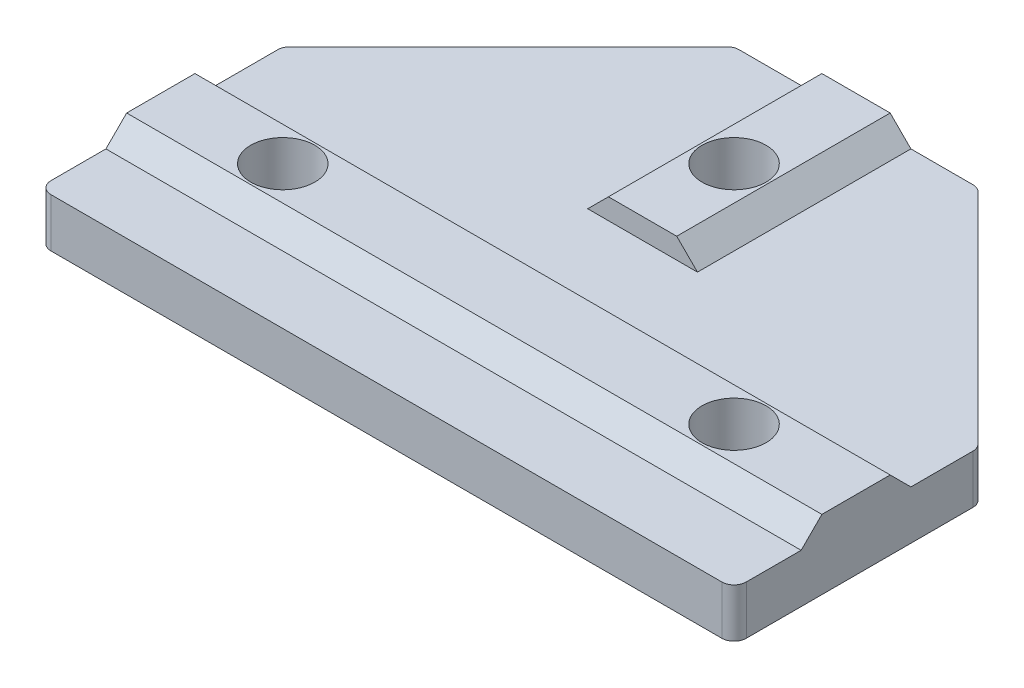
ISO-10303-21;
HEADER;
FILE_DESCRIPTION(('STEP AP214'),'2;1');
FILE_NAME('part.step','',(''),(''),'','','');
FILE_SCHEMA(('AUTOMOTIVE_DESIGN { 1 0 10303 214 1 1 1 1 }'));
ENDSEC;
DATA;
#1=APPLICATION_CONTEXT('core data for automotive mechanical design processes');
#2=APPLICATION_PROTOCOL_DEFINITION('international standard','automotive_design',2000,#1);
#3=PRODUCT_CONTEXT('',#1,'mechanical');
#4=PRODUCT('Part','Part','',(#3));
#5=PRODUCT_RELATED_PRODUCT_CATEGORY('part','',(#4));
#6=PRODUCT_DEFINITION_FORMATION('','',#4);
#7=PRODUCT_DEFINITION_CONTEXT('part definition',#1,'design');
#8=PRODUCT_DEFINITION('design','',#6,#7);
#9=PRODUCT_DEFINITION_SHAPE('','',#8);
#10=(LENGTH_UNIT() NAMED_UNIT(*) SI_UNIT(.MILLI.,.METRE.));
#11=(NAMED_UNIT(*) PLANE_ANGLE_UNIT() SI_UNIT($,.RADIAN.));
#12=(NAMED_UNIT(*) SI_UNIT($,.STERADIAN.) SOLID_ANGLE_UNIT());
#13=UNCERTAINTY_MEASURE_WITH_UNIT(LENGTH_MEASURE(1.E-05),#10,'distance_accuracy_value','');
#14=(GEOMETRIC_REPRESENTATION_CONTEXT(3) GLOBAL_UNCERTAINTY_ASSIGNED_CONTEXT((#13)) GLOBAL_UNIT_ASSIGNED_CONTEXT((#10,
#11,#12)) REPRESENTATION_CONTEXT('',''));
#15=CARTESIAN_POINT('',(0.,0.,0.));
#16=DIRECTION('',(0.,0.,1.));
#17=DIRECTION('',(1.,0.,0.));
#18=AXIS2_PLACEMENT_3D('',#15,#16,#17);
#19=CARTESIAN_POINT('',(0.,4.,0.));
#20=DIRECTION('',(0.,1.,0.));
#21=DIRECTION('',(0.,0.,1.));
#22=AXIS2_PLACEMENT_3D('',#19,#20,#21);
#23=PLANE('',#22);
#24=DIRECTION('',(0.,0.,1.));
#25=VECTOR('',#24,1.);
#26=CARTESIAN_POINT('',(0.,4.,-20.0000000000001));
#27=LINE('',#26,#25);
#28=CARTESIAN_POINT('',(0.,4.,-5.5));
#29=VERTEX_POINT('',#28);
#30=CARTESIAN_POINT('',(0.,4.,-1.));
#31=VERTEX_POINT('',#30);
#32=EDGE_CURVE('E173',#29,#31,#27,.T.);
#33=ORIENTED_EDGE('',*,*,#32,.T.);
#34=CARTESIAN_POINT('',(1.,4.,-1.));
#35=DIRECTION('',(0.,1.,0.));
#36=DIRECTION('',(0.,0.,1.));
#37=AXIS2_PLACEMENT_3D('',#34,#35,#36);
#38=CIRCLE('',#37,1.);
#39=CARTESIAN_POINT('',(1.,4.,0.));
#40=VERTEX_POINT('',#39);
#41=EDGE_CURVE('E250',#31,#40,#38,.T.);
#42=ORIENTED_EDGE('',*,*,#41,.T.);
#43=DIRECTION('',(1.,0.,0.));
#44=VECTOR('',#43,1.);
#45=CARTESIAN_POINT('',(0.,4.,0.));
#46=LINE('',#45,#44);
#47=CARTESIAN_POINT('',(56.,4.,0.));
#48=VERTEX_POINT('',#47);
#49=EDGE_CURVE('E342',#40,#48,#46,.T.);
#50=ORIENTED_EDGE('',*,*,#49,.T.);
#51=CARTESIAN_POINT('',(56.,4.,-1.));
#52=DIRECTION('',(0.,1.,0.));
#53=DIRECTION('',(0.,0.,1.));
#54=AXIS2_PLACEMENT_3D('',#51,#52,#53);
#55=CIRCLE('',#54,1.);
#56=CARTESIAN_POINT('',(57.,4.,-1.));
#57=VERTEX_POINT('',#56);
#58=EDGE_CURVE('E48',#48,#57,#55,.T.);
#59=ORIENTED_EDGE('',*,*,#58,.T.);
#60=DIRECTION('',(0.,0.,-1.));
#61=VECTOR('',#60,1.);
#62=CARTESIAN_POINT('',(57.,4.,0.));
#63=LINE('',#62,#61);
#64=CARTESIAN_POINT('',(57.,4.,-5.5));
#65=VERTEX_POINT('',#64);
#66=EDGE_CURVE('E175',#57,#65,#63,.T.);
#67=ORIENTED_EDGE('',*,*,#66,.T.);
#68=DIRECTION('',(1.,0.,0.));
#69=VECTOR('',#68,1.);
#70=CARTESIAN_POINT('',(0.,4.,-5.5));
#71=LINE('',#70,#69);
#72=EDGE_CURVE('E171',#29,#65,#71,.T.);
#73=ORIENTED_EDGE('',*,*,#72,.F.);
#74=EDGE_LOOP('',(#33,#42,#50,#59,#67,#73));
#75=FACE_BOUND('',#74,.T.);
#76=ADVANCED_FACE('F33',(#75),#23,.T.);
#77=DIRECTION('',(-1.,0.,0.));
#78=VECTOR('',#77,1.);
#79=CARTESIAN_POINT('',(38.5,4.,-38.5));
#80=LINE('',#79,#78);
#81=CARTESIAN_POINT('',(24.,4.,-38.5));
#82=VERTEX_POINT('',#81);
#83=CARTESIAN_POINT('',(18.9142135623731,4.,-38.5));
#84=VERTEX_POINT('',#83);
#85=EDGE_CURVE('E274',#82,#84,#80,.T.);
#86=ORIENTED_EDGE('',*,*,#85,.T.);
#87=CARTESIAN_POINT('',(18.9142135623731,4.,-37.5));
#88=DIRECTION('',(0.,1.,0.));
#89=DIRECTION('',(0.,0.,1.));
#90=AXIS2_PLACEMENT_3D('',#87,#88,#89);
#91=CIRCLE('',#90,1.);
#92=CARTESIAN_POINT('',(18.2071067811866,4.,-38.2071067811866));
#93=VERTEX_POINT('',#92);
#94=EDGE_CURVE('E239',#84,#93,#91,.T.);
#95=ORIENTED_EDGE('',*,*,#94,.T.);
#96=DIRECTION('',(-0.707106781186549,0.,0.707106781186546));
#97=VECTOR('',#96,1.);
#98=CARTESIAN_POINT('',(18.5,4.,-38.5));
#99=LINE('',#98,#97);
#100=CARTESIAN_POINT('',(0.292893218813459,4.,-20.2928932188135));
#101=VERTEX_POINT('',#100);
#102=EDGE_CURVE('E299',#93,#101,#99,.T.);
#103=ORIENTED_EDGE('',*,*,#102,.T.);
#104=CARTESIAN_POINT('',(1.,4.,-19.585786437627));
#105=DIRECTION('',(0.,1.,0.));
#106=DIRECTION('',(0.,0.,1.));
#107=AXIS2_PLACEMENT_3D('',#104,#105,#106);
#108=CIRCLE('',#107,1.);
#109=CARTESIAN_POINT('',(0.,4.,-19.585786437627));
#110=VERTEX_POINT('',#109);
#111=EDGE_CURVE('E237',#101,#110,#108,.T.);
#112=ORIENTED_EDGE('',*,*,#111,.T.);
#113=CARTESIAN_POINT('',(0.,4.,-14.5));
#114=VERTEX_POINT('',#113);
#115=EDGE_CURVE('E191',#110,#114,#27,.T.);
#116=ORIENTED_EDGE('',*,*,#115,.T.);
#117=DIRECTION('',(-1.,0.,0.));
#118=VECTOR('',#117,1.);
#119=CARTESIAN_POINT('',(0.,4.,-14.5));
#120=LINE('',#119,#118);
#121=CARTESIAN_POINT('',(57.,4.,-14.5));
#122=VERTEX_POINT('',#121);
#123=EDGE_CURVE('E179',#122,#114,#120,.T.);
#124=ORIENTED_EDGE('',*,*,#123,.F.);
#125=CARTESIAN_POINT('',(57.,4.,-19.585786437627));
#126=VERTEX_POINT('',#125);
#127=EDGE_CURVE('E344',#122,#126,#63,.T.);
#128=ORIENTED_EDGE('',*,*,#127,.T.);
#129=CARTESIAN_POINT('',(56.,4.,-19.585786437627));
#130=DIRECTION('',(0.,1.,0.));
#131=DIRECTION('',(0.,0.,1.));
#132=AXIS2_PLACEMENT_3D('',#129,#130,#131);
#133=CIRCLE('',#132,1.);
#134=CARTESIAN_POINT('',(56.7071067811865,4.,-20.2928932188135));
#135=VERTEX_POINT('',#134);
#136=EDGE_CURVE('E235',#126,#135,#133,.T.);
#137=ORIENTED_EDGE('',*,*,#136,.T.);
#138=DIRECTION('',(-0.707106781186549,0.,-0.707106781186546));
#139=VECTOR('',#138,1.);
#140=CARTESIAN_POINT('',(57.,4.,-20.0000000000001));
#141=LINE('',#140,#139);
#142=CARTESIAN_POINT('',(38.7928932188135,4.,-38.2071067811866));
#143=VERTEX_POINT('',#142);
#144=EDGE_CURVE('E262',#135,#143,#141,.T.);
#145=ORIENTED_EDGE('',*,*,#144,.T.);
#146=CARTESIAN_POINT('',(38.0857864376269,4.,-37.5));
#147=DIRECTION('',(0.,1.,0.));
#148=DIRECTION('',(0.,0.,1.));
#149=AXIS2_PLACEMENT_3D('',#146,#147,#148);
#150=CIRCLE('',#149,1.);
#151=CARTESIAN_POINT('',(38.0857864376269,4.,-38.5));
#152=VERTEX_POINT('',#151);
#153=EDGE_CURVE('E233',#143,#152,#150,.T.);
#154=ORIENTED_EDGE('',*,*,#153,.T.);
#155=CARTESIAN_POINT('',(33.,4.,-38.5));
#156=VERTEX_POINT('',#155);
#157=EDGE_CURVE('E284',#152,#156,#80,.T.);
#158=ORIENTED_EDGE('',*,*,#157,.T.);
#159=DIRECTION('',(0.,0.,-1.));
#160=VECTOR('',#159,1.);
#161=CARTESIAN_POINT('',(33.,4.,-38.5));
#162=LINE('',#161,#160);
#163=CARTESIAN_POINT('',(33.,4.,-21.));
#164=VERTEX_POINT('',#163);
#165=EDGE_CURVE('E320',#164,#156,#162,.T.);
#166=ORIENTED_EDGE('',*,*,#165,.F.);
#167=DIRECTION('',(1.,0.,0.));
#168=VECTOR('',#167,1.);
#169=CARTESIAN_POINT('',(33.,4.,-21.));
#170=LINE('',#169,#168);
#171=CARTESIAN_POINT('',(24.,4.,-21.));
#172=VERTEX_POINT('',#171);
#173=EDGE_CURVE('E334',#172,#164,#170,.T.);
#174=ORIENTED_EDGE('',*,*,#173,.F.);
#175=DIRECTION('',(0.,0.,1.));
#176=VECTOR('',#175,1.);
#177=CARTESIAN_POINT('',(24.,4.,-38.5));
#178=LINE('',#177,#176);
#179=EDGE_CURVE('E323',#82,#172,#178,.T.);
#180=ORIENTED_EDGE('',*,*,#179,.F.);
#181=EDGE_LOOP('',(#86,#95,#103,#112,#116,#124,#128,#137,#145,#154,#158,#166,#174,#180));
#182=FACE_BOUND('',#181,.T.);
#183=ADVANCED_FACE('F270',(#182),#23,.T.);
#184=CARTESIAN_POINT('',(0.,4.,-20.0000000000001));
#185=DIRECTION('',(1.,0.,0.));
#186=DIRECTION('',(0.,0.,-1.));
#187=AXIS2_PLACEMENT_3D('',#184,#185,#186);
#188=PLANE('',#187);
#189=ORIENTED_EDGE('',*,*,#115,.F.);
#190=DIRECTION('',(0.,-1.,0.));
#191=VECTOR('',#190,1.);
#192=CARTESIAN_POINT('',(0.,4.,-19.585786437627));
#193=LINE('',#192,#191);
#194=CARTESIAN_POINT('',(0.,0.,-19.585786437627));
#195=VERTEX_POINT('',#194);
#196=EDGE_CURVE('E242',#110,#195,#193,.T.);
#197=ORIENTED_EDGE('',*,*,#196,.T.);
#198=DIRECTION('',(0.,0.,1.));
#199=VECTOR('',#198,1.);
#200=CARTESIAN_POINT('',(0.,0.,-20.0000000000001));
#201=LINE('',#200,#199);
#202=CARTESIAN_POINT('',(0.,0.,-1.));
#203=VERTEX_POINT('',#202);
#204=EDGE_CURVE('E336',#195,#203,#201,.T.);
#205=ORIENTED_EDGE('',*,*,#204,.T.);
#206=DIRECTION('',(0.,-1.,0.));
#207=VECTOR('',#206,1.);
#208=CARTESIAN_POINT('',(0.,4.,-1.));
#209=LINE('',#208,#207);
#210=EDGE_CURVE('E190',#203,#31,#209,.F.);
#211=ORIENTED_EDGE('',*,*,#210,.T.);
#212=ORIENTED_EDGE('',*,*,#32,.F.);
#213=DIRECTION('',(0.,0.70710678118655,-0.707106781186545));
#214=VECTOR('',#213,1.);
#215=CARTESIAN_POINT('',(0.,5.7,-7.19999999999999));
#216=LINE('',#215,#214);
#217=CARTESIAN_POINT('',(0.,5.7,-7.19999999999999));
#218=VERTEX_POINT('',#217);
#219=EDGE_CURVE('E186',#29,#218,#216,.T.);
#220=ORIENTED_EDGE('',*,*,#219,.T.);
#221=DIRECTION('',(0.,0.,1.));
#222=VECTOR('',#221,1.);
#223=CARTESIAN_POINT('',(0.,5.7,-14.5));
#224=LINE('',#223,#222);
#225=CARTESIAN_POINT('',(0.,5.7,-12.8));
#226=VERTEX_POINT('',#225);
#227=EDGE_CURVE('E315',#226,#218,#224,.T.);
#228=ORIENTED_EDGE('',*,*,#227,.F.);
#229=DIRECTION('',(0.,-0.707106781186549,-0.707106781186546));
#230=VECTOR('',#229,1.);
#231=CARTESIAN_POINT('',(0.,5.7,-12.8));
#232=LINE('',#231,#230);
#233=EDGE_CURVE('E198',#226,#114,#232,.T.);
#234=ORIENTED_EDGE('',*,*,#233,.T.);
#235=EDGE_LOOP('',(#189,#197,#205,#211,#212,#220,#228,#234));
#236=FACE_BOUND('',#235,.T.);
#237=ADVANCED_FACE('F184',(#236),#188,.F.);
#238=CARTESIAN_POINT('',(0.,4.,0.));
#239=DIRECTION('',(0.,0.,-1.));
#240=DIRECTION('',(-1.,0.,0.));
#241=AXIS2_PLACEMENT_3D('',#238,#239,#240);
#242=PLANE('',#241);
#243=ORIENTED_EDGE('',*,*,#49,.F.);
#244=DIRECTION('',(0.,-1.,0.));
#245=VECTOR('',#244,1.);
#246=CARTESIAN_POINT('',(1.,4.,0.));
#247=LINE('',#246,#245);
#248=CARTESIAN_POINT('',(1.,0.,0.));
#249=VERTEX_POINT('',#248);
#250=EDGE_CURVE('E246',#40,#249,#247,.T.);
#251=ORIENTED_EDGE('',*,*,#250,.T.);
#252=DIRECTION('',(1.,0.,0.));
#253=VECTOR('',#252,1.);
#254=CARTESIAN_POINT('',(0.,0.,0.));
#255=LINE('',#254,#253);
#256=CARTESIAN_POINT('',(56.,0.,0.));
#257=VERTEX_POINT('',#256);
#258=EDGE_CURVE('E350',#249,#257,#255,.T.);
#259=ORIENTED_EDGE('',*,*,#258,.T.);
#260=DIRECTION('',(0.,-1.,0.));
#261=VECTOR('',#260,1.);
#262=CARTESIAN_POINT('',(56.,4.,0.));
#263=LINE('',#262,#261);
#264=EDGE_CURVE('E56',#257,#48,#263,.F.);
#265=ORIENTED_EDGE('',*,*,#264,.T.);
#266=EDGE_LOOP('',(#243,#251,#259,#265));
#267=FACE_BOUND('',#266,.T.);
#268=ADVANCED_FACE('F388',(#267),#242,.F.);
#269=CARTESIAN_POINT('',(57.,4.,0.));
#270=DIRECTION('',(-1.,0.,0.));
#271=DIRECTION('',(0.,0.,1.));
#272=AXIS2_PLACEMENT_3D('',#269,#270,#271);
#273=PLANE('',#272);
#274=ORIENTED_EDGE('',*,*,#66,.F.);
#275=DIRECTION('',(0.,-1.,0.));
#276=VECTOR('',#275,1.);
#277=CARTESIAN_POINT('',(57.,4.,-1.));
#278=LINE('',#277,#276);
#279=CARTESIAN_POINT('',(57.,0.,-1.));
#280=VERTEX_POINT('',#279);
#281=EDGE_CURVE('E254',#57,#280,#278,.T.);
#282=ORIENTED_EDGE('',*,*,#281,.T.);
#283=DIRECTION('',(0.,0.,-1.));
#284=VECTOR('',#283,1.);
#285=CARTESIAN_POINT('',(57.,0.,0.));
#286=LINE('',#285,#284);
#287=CARTESIAN_POINT('',(57.,0.,-19.585786437627));
#288=VERTEX_POINT('',#287);
#289=EDGE_CURVE('E291',#280,#288,#286,.T.);
#290=ORIENTED_EDGE('',*,*,#289,.T.);
#291=DIRECTION('',(0.,-1.,0.));
#292=VECTOR('',#291,1.);
#293=CARTESIAN_POINT('',(57.,4.,-19.585786437627));
#294=LINE('',#293,#292);
#295=EDGE_CURVE('E252',#288,#126,#294,.F.);
#296=ORIENTED_EDGE('',*,*,#295,.T.);
#297=ORIENTED_EDGE('',*,*,#127,.F.);
#298=DIRECTION('',(0.,0.707106781186549,0.707106781186546));
#299=VECTOR('',#298,1.);
#300=CARTESIAN_POINT('',(57.,5.7,-12.8));
#301=LINE('',#300,#299);
#302=CARTESIAN_POINT('',(57.,5.7,-12.8));
#303=VERTEX_POINT('',#302);
#304=EDGE_CURVE('E209',#122,#303,#301,.T.);
#305=ORIENTED_EDGE('',*,*,#304,.T.);
#306=DIRECTION('',(0.,0.,-1.));
#307=VECTOR('',#306,1.);
#308=CARTESIAN_POINT('',(57.,5.7,-14.5));
#309=LINE('',#308,#307);
#310=CARTESIAN_POINT('',(57.,5.7,-7.19999999999999));
#311=VERTEX_POINT('',#310);
#312=EDGE_CURVE('E313',#311,#303,#309,.T.);
#313=ORIENTED_EDGE('',*,*,#312,.F.);
#314=DIRECTION('',(0.,-0.70710678118655,0.707106781186545));
#315=VECTOR('',#314,1.);
#316=CARTESIAN_POINT('',(57.,5.7,-7.19999999999999));
#317=LINE('',#316,#315);
#318=EDGE_CURVE('E202',#311,#65,#317,.T.);
#319=ORIENTED_EDGE('',*,*,#318,.T.);
#320=EDGE_LOOP('',(#274,#282,#290,#296,#297,#305,#313,#319));
#321=FACE_BOUND('',#320,.T.);
#322=ADVANCED_FACE('F317',(#321),#273,.F.);
#323=CARTESIAN_POINT('',(57.,4.,-20.0000000000001));
#324=DIRECTION('',(-0.707106781186546,0.,0.707106781186549));
#325=DIRECTION('',(0.707106781186549,0.,0.707106781186546));
#326=AXIS2_PLACEMENT_3D('',#323,#324,#325);
#327=PLANE('',#326);
#328=ORIENTED_EDGE('',*,*,#144,.F.);
#329=DIRECTION('',(0.,-1.,0.));
#330=VECTOR('',#329,1.);
#331=CARTESIAN_POINT('',(56.7071067811865,4.,-20.2928932188135));
#332=LINE('',#331,#330);
#333=CARTESIAN_POINT('',(56.7071067811865,0.,-20.2928932188135));
#334=VERTEX_POINT('',#333);
#335=EDGE_CURVE('E11',#135,#334,#332,.T.);
#336=ORIENTED_EDGE('',*,*,#335,.T.);
#337=DIRECTION('',(-0.707106781186549,0.,-0.707106781186546));
#338=VECTOR('',#337,1.);
#339=CARTESIAN_POINT('',(57.,0.,-20.0000000000001));
#340=LINE('',#339,#338);
#341=CARTESIAN_POINT('',(38.7928932188135,0.,-38.2071067811866));
#342=VERTEX_POINT('',#341);
#343=EDGE_CURVE('E265',#334,#342,#340,.T.);
#344=ORIENTED_EDGE('',*,*,#343,.T.);
#345=DIRECTION('',(0.,-1.,0.));
#346=VECTOR('',#345,1.);
#347=CARTESIAN_POINT('',(38.7928932188135,4.,-38.2071067811866));
#348=LINE('',#347,#346);
#349=EDGE_CURVE('E41',#342,#143,#348,.F.);
#350=ORIENTED_EDGE('',*,*,#349,.T.);
#351=EDGE_LOOP('',(#328,#336,#344,#350));
#352=FACE_BOUND('',#351,.T.);
#353=ADVANCED_FACE('F261',(#352),#327,.F.);
#354=CARTESIAN_POINT('',(38.5,4.,-38.5));
#355=DIRECTION('',(0.,0.,1.));
#356=DIRECTION('',(1.,0.,0.));
#357=AXIS2_PLACEMENT_3D('',#354,#355,#356);
#358=PLANE('',#357);
#359=DIRECTION('',(-1.,0.,0.));
#360=VECTOR('',#359,1.);
#361=CARTESIAN_POINT('',(38.5,0.,-38.5));
#362=LINE('',#361,#360);
#363=CARTESIAN_POINT('',(38.0857864376269,0.,-38.5));
#364=VERTEX_POINT('',#363);
#365=CARTESIAN_POINT('',(18.9142135623731,0.,-38.5));
#366=VERTEX_POINT('',#365);
#367=EDGE_CURVE('E281',#364,#366,#362,.T.);
#368=ORIENTED_EDGE('',*,*,#367,.T.);
#369=DIRECTION('',(0.,-1.,0.));
#370=VECTOR('',#369,1.);
#371=CARTESIAN_POINT('',(18.9142135623731,4.,-38.5));
#372=LINE('',#371,#370);
#373=EDGE_CURVE('E231',#366,#84,#372,.F.);
#374=ORIENTED_EDGE('',*,*,#373,.T.);
#375=ORIENTED_EDGE('',*,*,#85,.F.);
#376=DIRECTION('',(-0.707106781186546,-0.707106781186549,0.));
#377=VECTOR('',#376,1.);
#378=CARTESIAN_POINT('',(25.7,5.7,-38.5));
#379=LINE('',#378,#377);
#380=CARTESIAN_POINT('',(25.7,5.7,-38.5));
#381=VERTEX_POINT('',#380);
#382=EDGE_CURVE('E302',#82,#381,#379,.F.);
#383=ORIENTED_EDGE('',*,*,#382,.T.);
#384=DIRECTION('',(-1.,0.,0.));
#385=VECTOR('',#384,1.);
#386=CARTESIAN_POINT('',(33.,5.7,-38.5));
#387=LINE('',#386,#385);
#388=CARTESIAN_POINT('',(31.3,5.7,-38.5));
#389=VERTEX_POINT('',#388);
#390=EDGE_CURVE('E330',#389,#381,#387,.T.);
#391=ORIENTED_EDGE('',*,*,#390,.F.);
#392=DIRECTION('',(-0.707106781186546,0.707106781186549,0.));
#393=VECTOR('',#392,1.);
#394=CARTESIAN_POINT('',(31.3,5.7,-38.5));
#395=LINE('',#394,#393);
#396=EDGE_CURVE('E304',#389,#156,#395,.F.);
#397=ORIENTED_EDGE('',*,*,#396,.T.);
#398=ORIENTED_EDGE('',*,*,#157,.F.);
#399=DIRECTION('',(0.,-1.,0.));
#400=VECTOR('',#399,1.);
#401=CARTESIAN_POINT('',(38.0857864376269,4.,-38.5));
#402=LINE('',#401,#400);
#403=EDGE_CURVE('E228',#152,#364,#402,.T.);
#404=ORIENTED_EDGE('',*,*,#403,.T.);
#405=EDGE_LOOP('',(#368,#374,#375,#383,#391,#397,#398,#404));
#406=FACE_BOUND('',#405,.T.);
#407=ADVANCED_FACE('F280',(#406),#358,.F.);
#408=CARTESIAN_POINT('',(18.5,4.,-38.5));
#409=DIRECTION('',(0.707106781186546,0.,0.707106781186549));
#410=DIRECTION('',(0.707106781186549,0.,-0.707106781186546));
#411=AXIS2_PLACEMENT_3D('',#408,#409,#410);
#412=PLANE('',#411);
#413=ORIENTED_EDGE('',*,*,#102,.F.);
#414=DIRECTION('',(0.,-1.,0.));
#415=VECTOR('',#414,1.);
#416=CARTESIAN_POINT('',(18.2071067811866,4.,-38.2071067811866));
#417=LINE('',#416,#415);
#418=CARTESIAN_POINT('',(18.2071067811866,0.,-38.2071067811866));
#419=VERTEX_POINT('',#418);
#420=EDGE_CURVE('E213',#93,#419,#417,.T.);
#421=ORIENTED_EDGE('',*,*,#420,.T.);
#422=DIRECTION('',(-0.707106781186549,0.,0.707106781186546));
#423=VECTOR('',#422,1.);
#424=CARTESIAN_POINT('',(18.5,0.,-38.5));
#425=LINE('',#424,#423);
#426=CARTESIAN_POINT('',(0.292893218813459,0.,-20.2928932188135));
#427=VERTEX_POINT('',#426);
#428=EDGE_CURVE('E192',#419,#427,#425,.T.);
#429=ORIENTED_EDGE('',*,*,#428,.T.);
#430=DIRECTION('',(0.,-1.,0.));
#431=VECTOR('',#430,1.);
#432=CARTESIAN_POINT('',(0.292893218813452,4.,-20.2928932188135));
#433=LINE('',#432,#431);
#434=EDGE_CURVE('E211',#427,#101,#433,.F.);
#435=ORIENTED_EDGE('',*,*,#434,.T.);
#436=EDGE_LOOP('',(#413,#421,#429,#435));
#437=FACE_BOUND('',#436,.T.);
#438=ADVANCED_FACE('F377',(#437),#412,.F.);
#439=CARTESIAN_POINT('',(0.,0.,0.));
#440=DIRECTION('',(0.,1.,0.));
#441=DIRECTION('',(0.,0.,1.));
#442=AXIS2_PLACEMENT_3D('',#439,#440,#441);
#443=PLANE('',#442);
#444=CARTESIAN_POINT('',(47.,0.,-10.));
#445=DIRECTION('',(0.,-1.,0.));
#446=DIRECTION('',(0.,0.,-1.));
#447=AXIS2_PLACEMENT_3D('',#444,#445,#446);
#448=CIRCLE('',#447,2.625);
#449=CARTESIAN_POINT('',(47.,0.,-12.625));
#450=VERTEX_POINT('',#449);
#451=EDGE_CURVE('E470',#450,#450,#448,.T.);
#452=ORIENTED_EDGE('',*,*,#451,.F.);
#453=EDGE_LOOP('',(#452));
#454=FACE_BOUND('',#453,.T.);
#455=CARTESIAN_POINT('',(28.5,0.,-28.5));
#456=DIRECTION('',(0.,-1.,0.));
#457=DIRECTION('',(0.,0.,-1.));
#458=AXIS2_PLACEMENT_3D('',#455,#456,#457);
#459=CIRCLE('',#458,2.625);
#460=CARTESIAN_POINT('',(28.5,0.,-31.125));
#461=VERTEX_POINT('',#460);
#462=EDGE_CURVE('E475',#461,#461,#459,.T.);
#463=ORIENTED_EDGE('',*,*,#462,.F.);
#464=EDGE_LOOP('',(#463));
#465=FACE_BOUND('',#464,.T.);
#466=CARTESIAN_POINT('',(10.,0.,-10.));
#467=DIRECTION('',(0.,-1.,0.));
#468=DIRECTION('',(0.,0.,-1.));
#469=AXIS2_PLACEMENT_3D('',#466,#467,#468);
#470=CIRCLE('',#469,2.625);
#471=CARTESIAN_POINT('',(10.,0.,-12.625));
#472=VERTEX_POINT('',#471);
#473=EDGE_CURVE('E473',#472,#472,#470,.T.);
#474=ORIENTED_EDGE('',*,*,#473,.F.);
#475=EDGE_LOOP('',(#474));
#476=FACE_BOUND('',#475,.T.);
#477=ORIENTED_EDGE('',*,*,#428,.F.);
#478=CARTESIAN_POINT('',(18.9142135623731,0.,-37.5));
#479=DIRECTION('',(0.,1.,0.));
#480=DIRECTION('',(0.,0.,1.));
#481=AXIS2_PLACEMENT_3D('',#478,#479,#480);
#482=CIRCLE('',#481,1.);
#483=EDGE_CURVE('E226',#419,#366,#482,.F.);
#484=ORIENTED_EDGE('',*,*,#483,.T.);
#485=ORIENTED_EDGE('',*,*,#367,.F.);
#486=CARTESIAN_POINT('',(38.0857864376269,0.,-37.5));
#487=DIRECTION('',(0.,1.,0.));
#488=DIRECTION('',(0.,0.,1.));
#489=AXIS2_PLACEMENT_3D('',#486,#487,#488);
#490=CIRCLE('',#489,1.);
#491=EDGE_CURVE('E216',#364,#342,#490,.F.);
#492=ORIENTED_EDGE('',*,*,#491,.T.);
#493=ORIENTED_EDGE('',*,*,#343,.F.);
#494=CARTESIAN_POINT('',(56.,0.,-19.585786437627));
#495=DIRECTION('',(0.,1.,0.));
#496=DIRECTION('',(0.,0.,1.));
#497=AXIS2_PLACEMENT_3D('',#494,#495,#496);
#498=CIRCLE('',#497,1.);
#499=EDGE_CURVE('E218',#334,#288,#498,.F.);
#500=ORIENTED_EDGE('',*,*,#499,.T.);
#501=ORIENTED_EDGE('',*,*,#289,.F.);
#502=CARTESIAN_POINT('',(56.,0.,-1.));
#503=DIRECTION('',(0.,1.,0.));
#504=DIRECTION('',(0.,0.,1.));
#505=AXIS2_PLACEMENT_3D('',#502,#503,#504);
#506=CIRCLE('',#505,1.);
#507=EDGE_CURVE('E220',#280,#257,#506,.F.);
#508=ORIENTED_EDGE('',*,*,#507,.T.);
#509=ORIENTED_EDGE('',*,*,#258,.F.);
#510=CARTESIAN_POINT('',(1.,0.,-1.));
#511=DIRECTION('',(0.,1.,0.));
#512=DIRECTION('',(0.,0.,1.));
#513=AXIS2_PLACEMENT_3D('',#510,#511,#512);
#514=CIRCLE('',#513,1.);
#515=EDGE_CURVE('E222',#249,#203,#514,.F.);
#516=ORIENTED_EDGE('',*,*,#515,.T.);
#517=ORIENTED_EDGE('',*,*,#204,.F.);
#518=CARTESIAN_POINT('',(1.,0.,-19.585786437627));
#519=DIRECTION('',(0.,1.,0.));
#520=DIRECTION('',(0.,0.,1.));
#521=AXIS2_PLACEMENT_3D('',#518,#519,#520);
#522=CIRCLE('',#521,1.);
#523=EDGE_CURVE('E224',#195,#427,#522,.F.);
#524=ORIENTED_EDGE('',*,*,#523,.T.);
#525=EDGE_LOOP('',(#477,#484,#485,#492,#493,#500,#501,#508,#509,#516,#517,#524));
#526=FACE_BOUND('',#525,.T.);
#527=ADVANCED_FACE('F287',(#454,#465,#476,#526),#443,.F.);
#528=CARTESIAN_POINT('',(33.,5.7,-21.));
#529=DIRECTION('',(0.,0.,-1.));
#530=DIRECTION('',(-1.,0.,0.));
#531=AXIS2_PLACEMENT_3D('',#528,#529,#530);
#532=PLANE('',#531);
#533=ORIENTED_EDGE('',*,*,#173,.T.);
#534=DIRECTION('',(0.707106781186546,-0.707106781186549,0.));
#535=VECTOR('',#534,1.);
#536=CARTESIAN_POINT('',(31.3,5.7,-21.));
#537=LINE('',#536,#535);
#538=CARTESIAN_POINT('',(31.3,5.7,-21.));
#539=VERTEX_POINT('',#538);
#540=EDGE_CURVE('E308',#164,#539,#537,.F.);
#541=ORIENTED_EDGE('',*,*,#540,.T.);
#542=DIRECTION('',(1.,0.,0.));
#543=VECTOR('',#542,1.);
#544=CARTESIAN_POINT('',(33.,5.7,-21.));
#545=LINE('',#544,#543);
#546=CARTESIAN_POINT('',(25.7,5.7,-21.));
#547=VERTEX_POINT('',#546);
#548=EDGE_CURVE('E333',#547,#539,#545,.T.);
#549=ORIENTED_EDGE('',*,*,#548,.F.);
#550=DIRECTION('',(0.707106781186546,0.707106781186549,0.));
#551=VECTOR('',#550,1.);
#552=CARTESIAN_POINT('',(25.7,5.7,-21.));
#553=LINE('',#552,#551);
#554=EDGE_CURVE('E306',#547,#172,#553,.F.);
#555=ORIENTED_EDGE('',*,*,#554,.T.);
#556=EDGE_LOOP('',(#533,#541,#549,#555));
#557=FACE_BOUND('',#556,.T.);
#558=ADVANCED_FACE('F373',(#557),#532,.F.);
#559=CARTESIAN_POINT('',(0.,5.7,0.));
#560=DIRECTION('',(0.,-1.,0.));
#561=DIRECTION('',(0.,0.,-1.));
#562=AXIS2_PLACEMENT_3D('',#559,#560,#561);
#563=PLANE('',#562);
#564=CARTESIAN_POINT('',(28.5,5.7,-28.5));
#565=DIRECTION('',(0.,-1.,0.));
#566=DIRECTION('',(0.,0.,-1.));
#567=AXIS2_PLACEMENT_3D('',#564,#565,#566);
#568=CIRCLE('',#567,2.625);
#569=CARTESIAN_POINT('',(28.5,5.7,-31.125));
#570=VERTEX_POINT('',#569);
#571=EDGE_CURVE('E471',#570,#570,#568,.T.);
#572=ORIENTED_EDGE('',*,*,#571,.T.);
#573=EDGE_LOOP('',(#572));
#574=FACE_BOUND('',#573,.T.);
#575=ORIENTED_EDGE('',*,*,#548,.T.);
#576=DIRECTION('',(0.,0.,-1.));
#577=VECTOR('',#576,1.);
#578=CARTESIAN_POINT('',(31.3,5.7,0.));
#579=LINE('',#578,#577);
#580=EDGE_CURVE('E298',#539,#389,#579,.T.);
#581=ORIENTED_EDGE('',*,*,#580,.T.);
#582=ORIENTED_EDGE('',*,*,#390,.T.);
#583=DIRECTION('',(0.,0.,1.));
#584=VECTOR('',#583,1.);
#585=CARTESIAN_POINT('',(25.7,5.7,0.));
#586=LINE('',#585,#584);
#587=EDGE_CURVE('E295',#381,#547,#586,.T.);
#588=ORIENTED_EDGE('',*,*,#587,.T.);
#589=EDGE_LOOP('',(#575,#581,#582,#588));
#590=FACE_BOUND('',#589,.T.);
#591=ADVANCED_FACE('F436',(#574,#590),#563,.F.);
#592=CARTESIAN_POINT('',(0.,5.7,0.));
#593=DIRECTION('',(0.,1.,0.));
#594=DIRECTION('',(0.,0.,1.));
#595=AXIS2_PLACEMENT_3D('',#592,#593,#594);
#596=PLANE('',#595);
#597=CARTESIAN_POINT('',(47.,5.7,-10.));
#598=DIRECTION('',(0.,-1.,0.));
#599=DIRECTION('',(0.,0.,-1.));
#600=AXIS2_PLACEMENT_3D('',#597,#598,#599);
#601=CIRCLE('',#600,2.625);
#602=CARTESIAN_POINT('',(47.,5.7,-12.625));
#603=VERTEX_POINT('',#602);
#604=EDGE_CURVE('E467',#603,#603,#601,.T.);
#605=ORIENTED_EDGE('',*,*,#604,.T.);
#606=EDGE_LOOP('',(#605));
#607=FACE_BOUND('',#606,.T.);
#608=CARTESIAN_POINT('',(10.,5.7,-10.));
#609=DIRECTION('',(0.,-1.,0.));
#610=DIRECTION('',(0.,0.,-1.));
#611=AXIS2_PLACEMENT_3D('',#608,#609,#610);
#612=CIRCLE('',#611,2.625);
#613=CARTESIAN_POINT('',(10.,5.7,-12.625));
#614=VERTEX_POINT('',#613);
#615=EDGE_CURVE('E180',#614,#614,#612,.T.);
#616=ORIENTED_EDGE('',*,*,#615,.T.);
#617=EDGE_LOOP('',(#616));
#618=FACE_BOUND('',#617,.T.);
#619=ORIENTED_EDGE('',*,*,#312,.T.);
#620=DIRECTION('',(-1.,0.,0.));
#621=VECTOR('',#620,1.);
#622=CARTESIAN_POINT('',(0.,5.7,-12.8));
#623=LINE('',#622,#621);
#624=EDGE_CURVE('E199',#303,#226,#623,.T.);
#625=ORIENTED_EDGE('',*,*,#624,.T.);
#626=ORIENTED_EDGE('',*,*,#227,.T.);
#627=DIRECTION('',(1.,0.,0.));
#628=VECTOR('',#627,1.);
#629=CARTESIAN_POINT('',(57.,5.7,-7.19999999999999));
#630=LINE('',#629,#628);
#631=EDGE_CURVE('E197',#218,#311,#630,.T.);
#632=ORIENTED_EDGE('',*,*,#631,.T.);
#633=EDGE_LOOP('',(#619,#625,#626,#632));
#634=FACE_BOUND('',#633,.T.);
#635=ADVANCED_FACE('F312',(#607,#618,#634),#596,.T.);
#636=CARTESIAN_POINT('',(31.3,5.7,0.));
#637=DIRECTION('',(-0.707106781186549,-0.707106781186546,0.));
#638=DIRECTION('',(0.,0.,-1.));
#639=AXIS2_PLACEMENT_3D('',#636,#637,#638);
#640=PLANE('',#639);
#641=ORIENTED_EDGE('',*,*,#540,.F.);
#642=ORIENTED_EDGE('',*,*,#165,.T.);
#643=ORIENTED_EDGE('',*,*,#396,.F.);
#644=ORIENTED_EDGE('',*,*,#580,.F.);
#645=EDGE_LOOP('',(#641,#642,#643,#644));
#646=FACE_BOUND('',#645,.T.);
#647=ADVANCED_FACE('F393',(#646),#640,.F.);
#648=CARTESIAN_POINT('',(0.,5.7,-12.8));
#649=DIRECTION('',(0.,0.707106781186546,-0.707106781186549));
#650=DIRECTION('',(1.,0.,0.));
#651=AXIS2_PLACEMENT_3D('',#648,#649,#650);
#652=PLANE('',#651);
#653=ORIENTED_EDGE('',*,*,#304,.F.);
#654=ORIENTED_EDGE('',*,*,#123,.T.);
#655=ORIENTED_EDGE('',*,*,#233,.F.);
#656=ORIENTED_EDGE('',*,*,#624,.F.);
#657=EDGE_LOOP('',(#653,#654,#655,#656));
#658=FACE_BOUND('',#657,.T.);
#659=ADVANCED_FACE('F396',(#658),#652,.T.);
#660=CARTESIAN_POINT('',(25.7,5.7,0.));
#661=DIRECTION('',(0.707106781186549,-0.707106781186546,0.));
#662=DIRECTION('',(0.,0.,1.));
#663=AXIS2_PLACEMENT_3D('',#660,#661,#662);
#664=PLANE('',#663);
#665=ORIENTED_EDGE('',*,*,#382,.F.);
#666=ORIENTED_EDGE('',*,*,#179,.T.);
#667=ORIENTED_EDGE('',*,*,#554,.F.);
#668=ORIENTED_EDGE('',*,*,#587,.F.);
#669=EDGE_LOOP('',(#665,#666,#667,#668));
#670=FACE_BOUND('',#669,.T.);
#671=ADVANCED_FACE('F400',(#670),#664,.F.);
#672=CARTESIAN_POINT('',(0.,5.7,-7.19999999999999));
#673=DIRECTION('',(0.,0.707106781186545,0.70710678118655));
#674=DIRECTION('',(-1.,0.,0.));
#675=AXIS2_PLACEMENT_3D('',#672,#673,#674);
#676=PLANE('',#675);
#677=ORIENTED_EDGE('',*,*,#219,.F.);
#678=ORIENTED_EDGE('',*,*,#72,.T.);
#679=ORIENTED_EDGE('',*,*,#318,.F.);
#680=ORIENTED_EDGE('',*,*,#631,.F.);
#681=EDGE_LOOP('',(#677,#678,#679,#680));
#682=FACE_BOUND('',#681,.T.);
#683=ADVANCED_FACE('F195',(#682),#676,.T.);
#684=CARTESIAN_POINT('',(10.,5.7,-10.));
#685=DIRECTION('',(0.,-1.,0.));
#686=DIRECTION('',(0.,0.,-1.));
#687=AXIS2_PLACEMENT_3D('',#684,#685,#686);
#688=CYLINDRICAL_SURFACE('',#687,2.625);
#689=ORIENTED_EDGE('',*,*,#615,.F.);
#690=EDGE_LOOP('',(#689));
#691=FACE_BOUND('',#690,.T.);
#692=ORIENTED_EDGE('',*,*,#473,.T.);
#693=EDGE_LOOP('',(#692));
#694=FACE_BOUND('',#693,.T.);
#695=ADVANCED_FACE('F407',(#691,#694),#688,.F.);
#696=CARTESIAN_POINT('',(47.,5.7,-10.));
#697=DIRECTION('',(0.,-1.,0.));
#698=DIRECTION('',(0.,0.,-1.));
#699=AXIS2_PLACEMENT_3D('',#696,#697,#698);
#700=CYLINDRICAL_SURFACE('',#699,2.625);
#701=ORIENTED_EDGE('',*,*,#604,.F.);
#702=EDGE_LOOP('',(#701));
#703=FACE_BOUND('',#702,.T.);
#704=ORIENTED_EDGE('',*,*,#451,.T.);
#705=EDGE_LOOP('',(#704));
#706=FACE_BOUND('',#705,.T.);
#707=ADVANCED_FACE('F455',(#703,#706),#700,.F.);
#708=CARTESIAN_POINT('',(28.5,5.7,-28.5));
#709=DIRECTION('',(0.,-1.,0.));
#710=DIRECTION('',(0.,0.,-1.));
#711=AXIS2_PLACEMENT_3D('',#708,#709,#710);
#712=CYLINDRICAL_SURFACE('',#711,2.625);
#713=ORIENTED_EDGE('',*,*,#571,.F.);
#714=EDGE_LOOP('',(#713));
#715=FACE_BOUND('',#714,.T.);
#716=ORIENTED_EDGE('',*,*,#462,.T.);
#717=EDGE_LOOP('',(#716));
#718=FACE_BOUND('',#717,.T.);
#719=ADVANCED_FACE('F412',(#715,#718),#712,.F.);
#720=CARTESIAN_POINT('',(18.9142135623731,4.,-37.5));
#721=DIRECTION('',(0.,-1.,0.));
#722=DIRECTION('',(0.,0.,-1.));
#723=AXIS2_PLACEMENT_3D('',#720,#721,#722);
#724=CYLINDRICAL_SURFACE('',#723,1.);
#725=ORIENTED_EDGE('',*,*,#94,.F.);
#726=ORIENTED_EDGE('',*,*,#373,.F.);
#727=ORIENTED_EDGE('',*,*,#483,.F.);
#728=ORIENTED_EDGE('',*,*,#420,.F.);
#729=EDGE_LOOP('',(#725,#726,#727,#728));
#730=FACE_BOUND('',#729,.T.);
#731=ADVANCED_FACE('F408',(#730),#724,.T.);
#732=CARTESIAN_POINT('',(1.,4.,-19.585786437627));
#733=DIRECTION('',(0.,-1.,0.));
#734=DIRECTION('',(0.,0.,-1.));
#735=AXIS2_PLACEMENT_3D('',#732,#733,#734);
#736=CYLINDRICAL_SURFACE('',#735,1.);
#737=ORIENTED_EDGE('',*,*,#111,.F.);
#738=ORIENTED_EDGE('',*,*,#434,.F.);
#739=ORIENTED_EDGE('',*,*,#523,.F.);
#740=ORIENTED_EDGE('',*,*,#196,.F.);
#741=EDGE_LOOP('',(#737,#738,#739,#740));
#742=FACE_BOUND('',#741,.T.);
#743=ADVANCED_FACE('F411',(#742),#736,.T.);
#744=CARTESIAN_POINT('',(1.,4.,-1.));
#745=DIRECTION('',(0.,-1.,0.));
#746=DIRECTION('',(0.,0.,-1.));
#747=AXIS2_PLACEMENT_3D('',#744,#745,#746);
#748=CYLINDRICAL_SURFACE('',#747,1.);
#749=ORIENTED_EDGE('',*,*,#41,.F.);
#750=ORIENTED_EDGE('',*,*,#210,.F.);
#751=ORIENTED_EDGE('',*,*,#515,.F.);
#752=ORIENTED_EDGE('',*,*,#250,.F.);
#753=EDGE_LOOP('',(#749,#750,#751,#752));
#754=FACE_BOUND('',#753,.T.);
#755=ADVANCED_FACE('F363',(#754),#748,.T.);
#756=CARTESIAN_POINT('',(56.,4.,-1.));
#757=DIRECTION('',(0.,-1.,0.));
#758=DIRECTION('',(0.,0.,-1.));
#759=AXIS2_PLACEMENT_3D('',#756,#757,#758);
#760=CYLINDRICAL_SURFACE('',#759,1.);
#761=ORIENTED_EDGE('',*,*,#58,.F.);
#762=ORIENTED_EDGE('',*,*,#264,.F.);
#763=ORIENTED_EDGE('',*,*,#507,.F.);
#764=ORIENTED_EDGE('',*,*,#281,.F.);
#765=EDGE_LOOP('',(#761,#762,#763,#764));
#766=FACE_BOUND('',#765,.T.);
#767=ADVANCED_FACE('F358',(#766),#760,.T.);
#768=CARTESIAN_POINT('',(56.,4.,-19.585786437627));
#769=DIRECTION('',(0.,-1.,0.));
#770=DIRECTION('',(0.,0.,-1.));
#771=AXIS2_PLACEMENT_3D('',#768,#769,#770);
#772=CYLINDRICAL_SURFACE('',#771,1.);
#773=ORIENTED_EDGE('',*,*,#136,.F.);
#774=ORIENTED_EDGE('',*,*,#295,.F.);
#775=ORIENTED_EDGE('',*,*,#499,.F.);
#776=ORIENTED_EDGE('',*,*,#335,.F.);
#777=EDGE_LOOP('',(#773,#774,#775,#776));
#778=FACE_BOUND('',#777,.T.);
#779=ADVANCED_FACE('F356',(#778),#772,.T.);
#780=CARTESIAN_POINT('',(38.0857864376269,4.,-37.5));
#781=DIRECTION('',(0.,-1.,0.));
#782=DIRECTION('',(0.,0.,-1.));
#783=AXIS2_PLACEMENT_3D('',#780,#781,#782);
#784=CYLINDRICAL_SURFACE('',#783,1.);
#785=ORIENTED_EDGE('',*,*,#153,.F.);
#786=ORIENTED_EDGE('',*,*,#349,.F.);
#787=ORIENTED_EDGE('',*,*,#491,.F.);
#788=ORIENTED_EDGE('',*,*,#403,.F.);
#789=EDGE_LOOP('',(#785,#786,#787,#788));
#790=FACE_BOUND('',#789,.T.);
#791=ADVANCED_FACE('F35',(#790),#784,.T.);
#792=CLOSED_SHELL('',(#76,#183,#237,#268,#322,#353,#407,#438,#527,#558,#591,#635,#647,#659,#671,
#683,#695,#707,#719,#731,#743,#755,#767,#779,#791));
#793=MANIFOLD_SOLID_BREP('B2',#792);
#794=ADVANCED_BREP_SHAPE_REPRESENTATION('',(#18,#793),#14);
#795=SHAPE_DEFINITION_REPRESENTATION(#9,#794);
ENDSEC;
END-ISO-10303-21;
